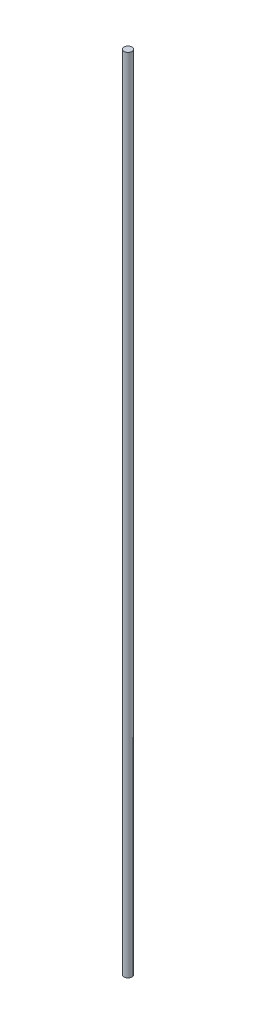
ISO-10303-21;
HEADER;
FILE_DESCRIPTION(('STEP AP214'),'2;1');
FILE_NAME('part.step','',(''),(''),'','','');
FILE_SCHEMA(('AUTOMOTIVE_DESIGN { 1 0 10303 214 1 1 1 1 }'));
ENDSEC;
DATA;
#1=APPLICATION_CONTEXT('core data for automotive mechanical design processes');
#2=APPLICATION_PROTOCOL_DEFINITION('international standard','automotive_design',2000,#1);
#3=PRODUCT_CONTEXT('',#1,'mechanical');
#4=PRODUCT('Part','Part','',(#3));
#5=PRODUCT_RELATED_PRODUCT_CATEGORY('part','',(#4));
#6=PRODUCT_DEFINITION_FORMATION('','',#4);
#7=PRODUCT_DEFINITION_CONTEXT('part definition',#1,'design');
#8=PRODUCT_DEFINITION('design','',#6,#7);
#9=PRODUCT_DEFINITION_SHAPE('','',#8);
#10=(LENGTH_UNIT() NAMED_UNIT(*) SI_UNIT(.MILLI.,.METRE.));
#11=(NAMED_UNIT(*) PLANE_ANGLE_UNIT() SI_UNIT($,.RADIAN.));
#12=(NAMED_UNIT(*) SI_UNIT($,.STERADIAN.) SOLID_ANGLE_UNIT());
#13=UNCERTAINTY_MEASURE_WITH_UNIT(LENGTH_MEASURE(1.E-05),#10,'distance_accuracy_value','');
#14=(GEOMETRIC_REPRESENTATION_CONTEXT(3) GLOBAL_UNCERTAINTY_ASSIGNED_CONTEXT((#13)) GLOBAL_UNIT_ASSIGNED_CONTEXT((#10,
#11,#12)) REPRESENTATION_CONTEXT('',''));
#15=CARTESIAN_POINT('',(0.,0.,0.));
#16=DIRECTION('',(0.,0.,1.));
#17=DIRECTION('',(1.,0.,0.));
#18=AXIS2_PLACEMENT_3D('',#15,#16,#17);
#19=CARTESIAN_POINT('',(0.,429.,0.));
#20=DIRECTION('',(0.,-1.,0.));
#21=DIRECTION('',(0.,0.,-1.));
#22=AXIS2_PLACEMENT_3D('',#19,#20,#21);
#23=CYLINDRICAL_SURFACE('',#22,2.1);
#24=CARTESIAN_POINT('',(0.,429.,0.));
#25=DIRECTION('',(0.,1.,0.));
#26=DIRECTION('',(0.,0.,1.));
#27=AXIS2_PLACEMENT_3D('',#24,#25,#26);
#28=CIRCLE('',#27,2.1);
#29=CARTESIAN_POINT('',(0.,429.,2.1));
#30=VERTEX_POINT('',#29);
#31=EDGE_CURVE('E10',#30,#30,#28,.T.);
#32=ORIENTED_EDGE('',*,*,#31,.F.);
#33=EDGE_LOOP('',(#32));
#34=FACE_BOUND('',#33,.T.);
#35=CARTESIAN_POINT('',(0.,0.,0.));
#36=DIRECTION('',(0.,1.,0.));
#37=DIRECTION('',(0.,0.,1.));
#38=AXIS2_PLACEMENT_3D('',#35,#36,#37);
#39=CIRCLE('',#38,2.1);
#40=CARTESIAN_POINT('',(0.,0.,2.1));
#41=VERTEX_POINT('',#40);
#42=EDGE_CURVE('E35',#41,#41,#39,.T.);
#43=ORIENTED_EDGE('',*,*,#42,.T.);
#44=EDGE_LOOP('',(#43));
#45=FACE_BOUND('',#44,.T.);
#46=ADVANCED_FACE('F32',(#34,#45),#23,.T.);
#47=CARTESIAN_POINT('',(0.,429.,0.));
#48=DIRECTION('',(0.,1.,0.));
#49=DIRECTION('',(0.,0.,1.));
#50=AXIS2_PLACEMENT_3D('',#47,#48,#49);
#51=PLANE('',#50);
#52=ORIENTED_EDGE('',*,*,#31,.T.);
#53=EDGE_LOOP('',(#52));
#54=FACE_BOUND('',#53,.T.);
#55=ADVANCED_FACE('F47',(#54),#51,.T.);
#56=CARTESIAN_POINT('',(0.,0.,0.));
#57=DIRECTION('',(0.,1.,0.));
#58=DIRECTION('',(0.,0.,1.));
#59=AXIS2_PLACEMENT_3D('',#56,#57,#58);
#60=PLANE('',#59);
#61=ORIENTED_EDGE('',*,*,#42,.F.);
#62=EDGE_LOOP('',(#61));
#63=FACE_BOUND('',#62,.T.);
#64=ADVANCED_FACE('F45',(#63),#60,.F.);
#65=CLOSED_SHELL('',(#46,#55,#64));
#66=MANIFOLD_SOLID_BREP('B2',#65);
#67=ADVANCED_BREP_SHAPE_REPRESENTATION('',(#18,#66),#14);
#68=SHAPE_DEFINITION_REPRESENTATION(#9,#67);
ENDSEC;
END-ISO-10303-21;
